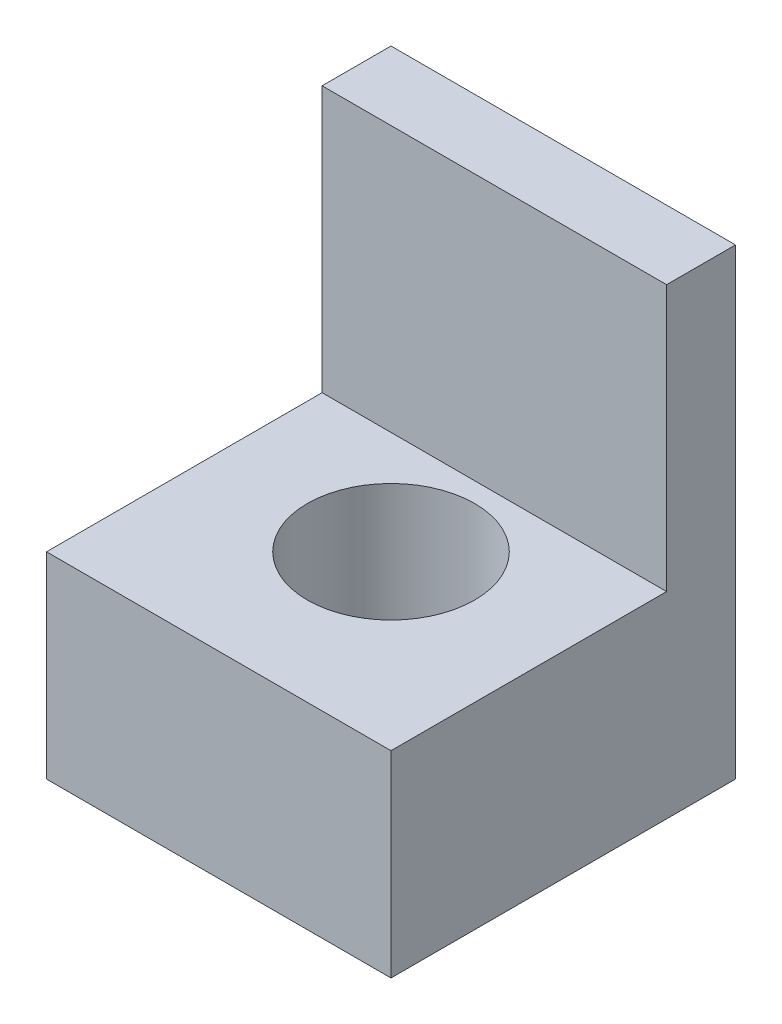
ISO-10303-21;
HEADER;
FILE_DESCRIPTION(('STEP AP214'),'2;1');
FILE_NAME('part.step','',(''),(''),'','','');
FILE_SCHEMA(('AUTOMOTIVE_DESIGN { 1 0 10303 214 1 1 1 1 }'));
ENDSEC;
DATA;
#1=APPLICATION_CONTEXT('core data for automotive mechanical design processes');
#2=APPLICATION_PROTOCOL_DEFINITION('international standard','automotive_design',2000,#1);
#3=PRODUCT_CONTEXT('',#1,'mechanical');
#4=PRODUCT('Part','Part','',(#3));
#5=PRODUCT_RELATED_PRODUCT_CATEGORY('part','',(#4));
#6=PRODUCT_DEFINITION_FORMATION('','',#4);
#7=PRODUCT_DEFINITION_CONTEXT('part definition',#1,'design');
#8=PRODUCT_DEFINITION('design','',#6,#7);
#9=PRODUCT_DEFINITION_SHAPE('','',#8);
#10=(LENGTH_UNIT() NAMED_UNIT(*) SI_UNIT(.MILLI.,.METRE.));
#11=(NAMED_UNIT(*) PLANE_ANGLE_UNIT() SI_UNIT($,.RADIAN.));
#12=(NAMED_UNIT(*) SI_UNIT($,.STERADIAN.) SOLID_ANGLE_UNIT());
#13=UNCERTAINTY_MEASURE_WITH_UNIT(LENGTH_MEASURE(1.E-05),#10,'distance_accuracy_value','');
#14=(GEOMETRIC_REPRESENTATION_CONTEXT(3) GLOBAL_UNCERTAINTY_ASSIGNED_CONTEXT((#13)) GLOBAL_UNIT_ASSIGNED_CONTEXT((#10,
#11,#12)) REPRESENTATION_CONTEXT('',''));
#15=CARTESIAN_POINT('',(0.,0.,0.));
#16=DIRECTION('',(0.,0.,1.));
#17=DIRECTION('',(1.,0.,0.));
#18=AXIS2_PLACEMENT_3D('',#15,#16,#17);
#19=CARTESIAN_POINT('',(0.,20.,0.));
#20=DIRECTION('',(0.,-1.,0.));
#21=DIRECTION('',(0.,0.,-1.));
#22=AXIS2_PLACEMENT_3D('',#19,#20,#21);
#23=PLANE('',#22);
#24=CARTESIAN_POINT('',(0.,20.,0.));
#25=DIRECTION('',(0.,-1.,0.));
#26=DIRECTION('',(0.,0.,-1.));
#27=AXIS2_PLACEMENT_3D('',#24,#25,#26);
#28=CIRCLE('',#27,8.5);
#29=CARTESIAN_POINT('',(0.,20.,-8.5));
#30=VERTEX_POINT('',#29);
#31=EDGE_CURVE('E138',#30,#30,#28,.T.);
#32=ORIENTED_EDGE('',*,*,#31,.T.);
#33=EDGE_LOOP('',(#32));
#34=FACE_BOUND('',#33,.T.);
#35=DIRECTION('',(1.,0.,0.));
#36=VECTOR('',#35,1.);
#37=CARTESIAN_POINT('',(-17.5,20.,-10.5));
#38=LINE('',#37,#36);
#39=CARTESIAN_POINT('',(-17.5,20.,-10.5));
#40=VERTEX_POINT('',#39);
#41=CARTESIAN_POINT('',(17.5,20.,-10.5));
#42=VERTEX_POINT('',#41);
#43=EDGE_CURVE('E54',#40,#42,#38,.T.);
#44=ORIENTED_EDGE('',*,*,#43,.F.);
#45=DIRECTION('',(0.,0.,1.));
#46=VECTOR('',#45,1.);
#47=CARTESIAN_POINT('',(-17.5,20.,17.5));
#48=LINE('',#47,#46);
#49=CARTESIAN_POINT('',(-17.5,20.,17.5));
#50=VERTEX_POINT('',#49);
#51=EDGE_CURVE('E140',#40,#50,#48,.T.);
#52=ORIENTED_EDGE('',*,*,#51,.T.);
#53=DIRECTION('',(1.,0.,0.));
#54=VECTOR('',#53,1.);
#55=CARTESIAN_POINT('',(-17.5,20.,17.5));
#56=LINE('',#55,#54);
#57=CARTESIAN_POINT('',(17.5,20.,17.5));
#58=VERTEX_POINT('',#57);
#59=EDGE_CURVE('E60',#50,#58,#56,.T.);
#60=ORIENTED_EDGE('',*,*,#59,.T.);
#61=DIRECTION('',(0.,0.,-1.));
#62=VECTOR('',#61,1.);
#63=CARTESIAN_POINT('',(17.5,20.,17.5));
#64=LINE('',#63,#62);
#65=EDGE_CURVE('E89',#58,#42,#64,.T.);
#66=ORIENTED_EDGE('',*,*,#65,.T.);
#67=EDGE_LOOP('',(#44,#52,#60,#66));
#68=FACE_BOUND('',#67,.T.);
#69=ADVANCED_FACE('F39',(#34,#68),#23,.F.);
#70=CARTESIAN_POINT('',(17.5,20.,17.5));
#71=DIRECTION('',(-1.,0.,0.));
#72=DIRECTION('',(0.,0.,1.));
#73=AXIS2_PLACEMENT_3D('',#70,#71,#72);
#74=PLANE('',#73);
#75=DIRECTION('',(0.,0.,-1.));
#76=VECTOR('',#75,1.);
#77=CARTESIAN_POINT('',(17.5,0.,17.5));
#78=LINE('',#77,#76);
#79=CARTESIAN_POINT('',(17.5,0.,17.5));
#80=VERTEX_POINT('',#79);
#81=CARTESIAN_POINT('',(17.5,0.,-17.5));
#82=VERTEX_POINT('',#81);
#83=EDGE_CURVE('E95',#80,#82,#78,.T.);
#84=ORIENTED_EDGE('',*,*,#83,.T.);
#85=DIRECTION('',(0.,-1.,0.));
#86=VECTOR('',#85,1.);
#87=CARTESIAN_POINT('',(17.5,20.,-17.5));
#88=LINE('',#87,#86);
#89=CARTESIAN_POINT('',(17.5,47.,-17.5));
#90=VERTEX_POINT('',#89);
#91=EDGE_CURVE('E11',#90,#82,#88,.T.);
#92=ORIENTED_EDGE('',*,*,#91,.F.);
#93=DIRECTION('',(0.,0.,-1.));
#94=VECTOR('',#93,1.);
#95=CARTESIAN_POINT('',(17.5,47.,-17.5));
#96=LINE('',#95,#94);
#97=CARTESIAN_POINT('',(17.5,47.,-10.5));
#98=VERTEX_POINT('',#97);
#99=EDGE_CURVE('E131',#98,#90,#96,.T.);
#100=ORIENTED_EDGE('',*,*,#99,.F.);
#101=DIRECTION('',(0.,-1.,0.));
#102=VECTOR('',#101,1.);
#103=CARTESIAN_POINT('',(17.5,47.,-10.5));
#104=LINE('',#103,#102);
#105=EDGE_CURVE('E104',#98,#42,#104,.T.);
#106=ORIENTED_EDGE('',*,*,#105,.T.);
#107=ORIENTED_EDGE('',*,*,#65,.F.);
#108=DIRECTION('',(0.,-1.,0.));
#109=VECTOR('',#108,1.);
#110=CARTESIAN_POINT('',(17.5,20.,17.5));
#111=LINE('',#110,#109);
#112=EDGE_CURVE('E82',#58,#80,#111,.T.);
#113=ORIENTED_EDGE('',*,*,#112,.T.);
#114=EDGE_LOOP('',(#84,#92,#100,#106,#107,#113));
#115=FACE_BOUND('',#114,.T.);
#116=ADVANCED_FACE('F41',(#115),#74,.F.);
#117=CARTESIAN_POINT('',(-17.5,20.,-17.5));
#118=DIRECTION('',(0.,0.,1.));
#119=DIRECTION('',(1.,0.,0.));
#120=AXIS2_PLACEMENT_3D('',#117,#118,#119);
#121=PLANE('',#120);
#122=DIRECTION('',(-1.,0.,0.));
#123=VECTOR('',#122,1.);
#124=CARTESIAN_POINT('',(-17.5,0.,-17.5));
#125=LINE('',#124,#123);
#126=CARTESIAN_POINT('',(-17.5,0.,-17.5));
#127=VERTEX_POINT('',#126);
#128=EDGE_CURVE('E99',#82,#127,#125,.T.);
#129=ORIENTED_EDGE('',*,*,#128,.T.);
#130=DIRECTION('',(0.,-1.,0.));
#131=VECTOR('',#130,1.);
#132=CARTESIAN_POINT('',(-17.5,20.,-17.5));
#133=LINE('',#132,#131);
#134=CARTESIAN_POINT('',(-17.5,47.,-17.5));
#135=VERTEX_POINT('',#134);
#136=EDGE_CURVE('E47',#135,#127,#133,.T.);
#137=ORIENTED_EDGE('',*,*,#136,.F.);
#138=DIRECTION('',(-1.,0.,0.));
#139=VECTOR('',#138,1.);
#140=CARTESIAN_POINT('',(-17.5,47.,-17.5));
#141=LINE('',#140,#139);
#142=EDGE_CURVE('E123',#90,#135,#141,.T.);
#143=ORIENTED_EDGE('',*,*,#142,.F.);
#144=ORIENTED_EDGE('',*,*,#91,.T.);
#145=EDGE_LOOP('',(#129,#137,#143,#144));
#146=FACE_BOUND('',#145,.T.);
#147=ADVANCED_FACE('F121',(#146),#121,.F.);
#148=CARTESIAN_POINT('',(-17.5,20.,17.5));
#149=DIRECTION('',(1.,0.,0.));
#150=DIRECTION('',(0.,0.,-1.));
#151=AXIS2_PLACEMENT_3D('',#148,#149,#150);
#152=PLANE('',#151);
#153=DIRECTION('',(0.,0.,1.));
#154=VECTOR('',#153,1.);
#155=CARTESIAN_POINT('',(-17.5,0.,17.5));
#156=LINE('',#155,#154);
#157=CARTESIAN_POINT('',(-17.5,0.,17.5));
#158=VERTEX_POINT('',#157);
#159=EDGE_CURVE('E90',#127,#158,#156,.T.);
#160=ORIENTED_EDGE('',*,*,#159,.T.);
#161=DIRECTION('',(0.,-1.,0.));
#162=VECTOR('',#161,1.);
#163=CARTESIAN_POINT('',(-17.5,20.,17.5));
#164=LINE('',#163,#162);
#165=EDGE_CURVE('E85',#50,#158,#164,.T.);
#166=ORIENTED_EDGE('',*,*,#165,.F.);
#167=ORIENTED_EDGE('',*,*,#51,.F.);
#168=DIRECTION('',(0.,-1.,0.));
#169=VECTOR('',#168,1.);
#170=CARTESIAN_POINT('',(-17.5,47.,-10.5));
#171=LINE('',#170,#169);
#172=CARTESIAN_POINT('',(-17.5,47.,-10.5));
#173=VERTEX_POINT('',#172);
#174=EDGE_CURVE('E100',#173,#40,#171,.T.);
#175=ORIENTED_EDGE('',*,*,#174,.F.);
#176=DIRECTION('',(0.,0.,1.));
#177=VECTOR('',#176,1.);
#178=CARTESIAN_POINT('',(-17.5,47.,-17.5));
#179=LINE('',#178,#177);
#180=EDGE_CURVE('E117',#135,#173,#179,.T.);
#181=ORIENTED_EDGE('',*,*,#180,.F.);
#182=ORIENTED_EDGE('',*,*,#136,.T.);
#183=EDGE_LOOP('',(#160,#166,#167,#175,#181,#182));
#184=FACE_BOUND('',#183,.T.);
#185=ADVANCED_FACE('F114',(#184),#152,.F.);
#186=CARTESIAN_POINT('',(-17.5,20.,17.5));
#187=DIRECTION('',(0.,0.,-1.));
#188=DIRECTION('',(-1.,0.,0.));
#189=AXIS2_PLACEMENT_3D('',#186,#187,#188);
#190=PLANE('',#189);
#191=DIRECTION('',(1.,0.,0.));
#192=VECTOR('',#191,1.);
#193=CARTESIAN_POINT('',(-17.5,0.,17.5));
#194=LINE('',#193,#192);
#195=EDGE_CURVE('E79',#158,#80,#194,.T.);
#196=ORIENTED_EDGE('',*,*,#195,.T.);
#197=ORIENTED_EDGE('',*,*,#112,.F.);
#198=ORIENTED_EDGE('',*,*,#59,.F.);
#199=ORIENTED_EDGE('',*,*,#165,.T.);
#200=EDGE_LOOP('',(#196,#197,#198,#199));
#201=FACE_BOUND('',#200,.T.);
#202=ADVANCED_FACE('F81',(#201),#190,.F.);
#203=CARTESIAN_POINT('',(0.,0.,0.));
#204=DIRECTION('',(0.,-1.,0.));
#205=DIRECTION('',(0.,0.,-1.));
#206=AXIS2_PLACEMENT_3D('',#203,#204,#205);
#207=PLANE('',#206);
#208=CARTESIAN_POINT('',(12.5,0.,-5.5));
#209=DIRECTION('',(0.,-1.,0.));
#210=DIRECTION('',(0.,0.,-1.));
#211=AXIS2_PLACEMENT_3D('',#208,#209,#210);
#212=CIRCLE('',#211,1.24999999999999);
#213=CARTESIAN_POINT('',(12.5,0.,-6.74999999999999));
#214=VERTEX_POINT('',#213);
#215=EDGE_CURVE('E176',#214,#214,#212,.T.);
#216=ORIENTED_EDGE('',*,*,#215,.F.);
#217=EDGE_LOOP('',(#216));
#218=FACE_BOUND('',#217,.T.);
#219=CARTESIAN_POINT('',(-12.5,0.,-5.5));
#220=DIRECTION('',(0.,-1.,0.));
#221=DIRECTION('',(0.,0.,-1.));
#222=AXIS2_PLACEMENT_3D('',#219,#220,#221);
#223=CIRCLE('',#222,1.24999999999999);
#224=CARTESIAN_POINT('',(-12.5,0.,-6.74999999999999));
#225=VERTEX_POINT('',#224);
#226=EDGE_CURVE('E170',#225,#225,#223,.T.);
#227=ORIENTED_EDGE('',*,*,#226,.F.);
#228=EDGE_LOOP('',(#227));
#229=FACE_BOUND('',#228,.T.);
#230=CARTESIAN_POINT('',(-12.5,0.,12.5));
#231=DIRECTION('',(0.,-1.,0.));
#232=DIRECTION('',(0.,0.,-1.));
#233=AXIS2_PLACEMENT_3D('',#230,#231,#232);
#234=CIRCLE('',#233,1.24999999999999);
#235=CARTESIAN_POINT('',(-12.5,0.,11.25));
#236=VERTEX_POINT('',#235);
#237=EDGE_CURVE('E164',#236,#236,#234,.T.);
#238=ORIENTED_EDGE('',*,*,#237,.F.);
#239=EDGE_LOOP('',(#238));
#240=FACE_BOUND('',#239,.T.);
#241=CARTESIAN_POINT('',(12.5,0.,12.5));
#242=DIRECTION('',(0.,-1.,0.));
#243=DIRECTION('',(0.,0.,-1.));
#244=AXIS2_PLACEMENT_3D('',#241,#242,#243);
#245=CIRCLE('',#244,1.24999999999999);
#246=CARTESIAN_POINT('',(12.5,0.,11.25));
#247=VERTEX_POINT('',#246);
#248=EDGE_CURVE('E158',#247,#247,#245,.T.);
#249=ORIENTED_EDGE('',*,*,#248,.F.);
#250=EDGE_LOOP('',(#249));
#251=FACE_BOUND('',#250,.T.);
#252=CARTESIAN_POINT('',(0.,0.,0.));
#253=DIRECTION('',(0.,-1.,0.));
#254=DIRECTION('',(0.,0.,-1.));
#255=AXIS2_PLACEMENT_3D('',#252,#253,#254);
#256=CIRCLE('',#255,8.5);
#257=CARTESIAN_POINT('',(0.,0.,-8.5));
#258=VERTEX_POINT('',#257);
#259=EDGE_CURVE('E150',#258,#258,#256,.T.);
#260=ORIENTED_EDGE('',*,*,#259,.F.);
#261=EDGE_LOOP('',(#260));
#262=FACE_BOUND('',#261,.T.);
#263=ORIENTED_EDGE('',*,*,#83,.F.);
#264=ORIENTED_EDGE('',*,*,#195,.F.);
#265=ORIENTED_EDGE('',*,*,#159,.F.);
#266=ORIENTED_EDGE('',*,*,#128,.F.);
#267=EDGE_LOOP('',(#263,#264,#265,#266));
#268=FACE_BOUND('',#267,.T.);
#269=ADVANCED_FACE('F98',(#218,#229,#240,#251,#262,#268),#207,.T.);
#270=CARTESIAN_POINT('',(-17.5,47.,-10.5));
#271=DIRECTION('',(0.,0.,-1.));
#272=DIRECTION('',(-1.,0.,0.));
#273=AXIS2_PLACEMENT_3D('',#270,#271,#272);
#274=PLANE('',#273);
#275=ORIENTED_EDGE('',*,*,#43,.T.);
#276=ORIENTED_EDGE('',*,*,#105,.F.);
#277=DIRECTION('',(1.,0.,0.));
#278=VECTOR('',#277,1.);
#279=CARTESIAN_POINT('',(-17.5,47.,-10.5));
#280=LINE('',#279,#278);
#281=EDGE_CURVE('E134',#173,#98,#280,.T.);
#282=ORIENTED_EDGE('',*,*,#281,.F.);
#283=ORIENTED_EDGE('',*,*,#174,.T.);
#284=EDGE_LOOP('',(#275,#276,#282,#283));
#285=FACE_BOUND('',#284,.T.);
#286=ADVANCED_FACE('F143',(#285),#274,.F.);
#287=CARTESIAN_POINT('',(0.,47.,0.));
#288=DIRECTION('',(0.,1.,0.));
#289=DIRECTION('',(0.,0.,1.));
#290=AXIS2_PLACEMENT_3D('',#287,#288,#289);
#291=PLANE('',#290);
#292=ORIENTED_EDGE('',*,*,#180,.T.);
#293=ORIENTED_EDGE('',*,*,#281,.T.);
#294=ORIENTED_EDGE('',*,*,#99,.T.);
#295=ORIENTED_EDGE('',*,*,#142,.T.);
#296=EDGE_LOOP('',(#292,#293,#294,#295));
#297=FACE_BOUND('',#296,.T.);
#298=ADVANCED_FACE('F127',(#297),#291,.T.);
#299=CARTESIAN_POINT('',(0.,20.,0.));
#300=DIRECTION('',(0.,-1.,0.));
#301=DIRECTION('',(0.,0.,-1.));
#302=AXIS2_PLACEMENT_3D('',#299,#300,#301);
#303=CYLINDRICAL_SURFACE('',#302,8.5);
#304=ORIENTED_EDGE('',*,*,#31,.F.);
#305=EDGE_LOOP('',(#304));
#306=FACE_BOUND('',#305,.T.);
#307=ORIENTED_EDGE('',*,*,#259,.T.);
#308=EDGE_LOOP('',(#307));
#309=FACE_BOUND('',#308,.T.);
#310=ADVANCED_FACE('F193',(#306,#309),#303,.F.);
#311=CARTESIAN_POINT('',(12.5,7.50000000000001,12.5));
#312=DIRECTION('',(0.,-1.,0.));
#313=DIRECTION('',(0.,0.,-1.));
#314=AXIS2_PLACEMENT_3D('',#311,#312,#313);
#315=CONICAL_SURFACE('',#314,1.24999999999999,1.02974425867665);
#316=CARTESIAN_POINT('',(12.5,8.25107577378445,12.5));
#317=VERTEX_POINT('',#316);
#318=VERTEX_LOOP('',#317);
#319=FACE_BOUND('',#318,.T.);
#320=CARTESIAN_POINT('',(12.5,7.50000000000001,12.5));
#321=DIRECTION('',(0.,-1.,0.));
#322=DIRECTION('',(0.,0.,-1.));
#323=AXIS2_PLACEMENT_3D('',#320,#321,#322);
#324=CIRCLE('',#323,1.24999999999999);
#325=CARTESIAN_POINT('',(12.5,7.50000000000001,11.25));
#326=VERTEX_POINT('',#325);
#327=EDGE_CURVE('E153',#326,#326,#324,.T.);
#328=ORIENTED_EDGE('',*,*,#327,.T.);
#329=EDGE_LOOP('',(#328));
#330=FACE_BOUND('',#329,.T.);
#331=ADVANCED_FACE('F195',(#319,#330),#315,.F.);
#332=CARTESIAN_POINT('',(12.5,0.,12.5));
#333=DIRECTION('',(0.,-1.,0.));
#334=DIRECTION('',(0.,0.,-1.));
#335=AXIS2_PLACEMENT_3D('',#332,#333,#334);
#336=CYLINDRICAL_SURFACE('',#335,1.24999999999999);
#337=ORIENTED_EDGE('',*,*,#327,.F.);
#338=EDGE_LOOP('',(#337));
#339=FACE_BOUND('',#338,.T.);
#340=ORIENTED_EDGE('',*,*,#248,.T.);
#341=EDGE_LOOP('',(#340));
#342=FACE_BOUND('',#341,.T.);
#343=ADVANCED_FACE('F202',(#339,#342),#336,.F.);
#344=CARTESIAN_POINT('',(-12.5,7.50000000000001,12.5));
#345=DIRECTION('',(0.,-1.,0.));
#346=DIRECTION('',(0.,0.,-1.));
#347=AXIS2_PLACEMENT_3D('',#344,#345,#346);
#348=CONICAL_SURFACE('',#347,1.24999999999999,1.02974425867665);
#349=CARTESIAN_POINT('',(-12.5,8.25107577378445,12.5));
#350=VERTEX_POINT('',#349);
#351=VERTEX_LOOP('',#350);
#352=FACE_BOUND('',#351,.T.);
#353=CARTESIAN_POINT('',(-12.5,7.50000000000001,12.5));
#354=DIRECTION('',(0.,-1.,0.));
#355=DIRECTION('',(0.,0.,-1.));
#356=AXIS2_PLACEMENT_3D('',#353,#354,#355);
#357=CIRCLE('',#356,1.24999999999999);
#358=CARTESIAN_POINT('',(-12.5,7.50000000000001,11.25));
#359=VERTEX_POINT('',#358);
#360=EDGE_CURVE('E161',#359,#359,#357,.T.);
#361=ORIENTED_EDGE('',*,*,#360,.T.);
#362=EDGE_LOOP('',(#361));
#363=FACE_BOUND('',#362,.T.);
#364=ADVANCED_FACE('F268',(#352,#363),#348,.F.);
#365=CARTESIAN_POINT('',(-12.5,0.,12.5));
#366=DIRECTION('',(0.,-1.,0.));
#367=DIRECTION('',(0.,0.,-1.));
#368=AXIS2_PLACEMENT_3D('',#365,#366,#367);
#369=CYLINDRICAL_SURFACE('',#368,1.24999999999999);
#370=ORIENTED_EDGE('',*,*,#360,.F.);
#371=EDGE_LOOP('',(#370));
#372=FACE_BOUND('',#371,.T.);
#373=ORIENTED_EDGE('',*,*,#237,.T.);
#374=EDGE_LOOP('',(#373));
#375=FACE_BOUND('',#374,.T.);
#376=ADVANCED_FACE('F278',(#372,#375),#369,.F.);
#377=CARTESIAN_POINT('',(-12.5,7.50000000000001,-5.5));
#378=DIRECTION('',(0.,-1.,0.));
#379=DIRECTION('',(0.,0.,-1.));
#380=AXIS2_PLACEMENT_3D('',#377,#378,#379);
#381=CONICAL_SURFACE('',#380,1.24999999999999,1.02974425867665);
#382=CARTESIAN_POINT('',(-12.5,8.25107577378445,-5.5));
#383=VERTEX_POINT('',#382);
#384=VERTEX_LOOP('',#383);
#385=FACE_BOUND('',#384,.T.);
#386=CARTESIAN_POINT('',(-12.5,7.50000000000001,-5.5));
#387=DIRECTION('',(0.,-1.,0.));
#388=DIRECTION('',(0.,0.,-1.));
#389=AXIS2_PLACEMENT_3D('',#386,#387,#388);
#390=CIRCLE('',#389,1.24999999999999);
#391=CARTESIAN_POINT('',(-12.5,7.50000000000001,-6.74999999999999));
#392=VERTEX_POINT('',#391);
#393=EDGE_CURVE('E167',#392,#392,#390,.T.);
#394=ORIENTED_EDGE('',*,*,#393,.T.);
#395=EDGE_LOOP('',(#394));
#396=FACE_BOUND('',#395,.T.);
#397=ADVANCED_FACE('F287',(#385,#396),#381,.F.);
#398=CARTESIAN_POINT('',(-12.5,0.,-5.5));
#399=DIRECTION('',(0.,-1.,0.));
#400=DIRECTION('',(0.,0.,-1.));
#401=AXIS2_PLACEMENT_3D('',#398,#399,#400);
#402=CYLINDRICAL_SURFACE('',#401,1.24999999999999);
#403=ORIENTED_EDGE('',*,*,#393,.F.);
#404=EDGE_LOOP('',(#403));
#405=FACE_BOUND('',#404,.T.);
#406=ORIENTED_EDGE('',*,*,#226,.T.);
#407=EDGE_LOOP('',(#406));
#408=FACE_BOUND('',#407,.T.);
#409=ADVANCED_FACE('F297',(#405,#408),#402,.F.);
#410=CARTESIAN_POINT('',(12.5,7.50000000000001,-5.5));
#411=DIRECTION('',(0.,-1.,0.));
#412=DIRECTION('',(0.,0.,-1.));
#413=AXIS2_PLACEMENT_3D('',#410,#411,#412);
#414=CONICAL_SURFACE('',#413,1.24999999999999,1.02974425867665);
#415=CARTESIAN_POINT('',(12.5,8.25107577378445,-5.5));
#416=VERTEX_POINT('',#415);
#417=VERTEX_LOOP('',#416);
#418=FACE_BOUND('',#417,.T.);
#419=CARTESIAN_POINT('',(12.5,7.50000000000001,-5.5));
#420=DIRECTION('',(0.,-1.,0.));
#421=DIRECTION('',(0.,0.,-1.));
#422=AXIS2_PLACEMENT_3D('',#419,#420,#421);
#423=CIRCLE('',#422,1.24999999999999);
#424=CARTESIAN_POINT('',(12.5,7.50000000000001,-6.74999999999999));
#425=VERTEX_POINT('',#424);
#426=EDGE_CURVE('E173',#425,#425,#423,.T.);
#427=ORIENTED_EDGE('',*,*,#426,.T.);
#428=EDGE_LOOP('',(#427));
#429=FACE_BOUND('',#428,.T.);
#430=ADVANCED_FACE('F306',(#418,#429),#414,.F.);
#431=CARTESIAN_POINT('',(12.5,0.,-5.5));
#432=DIRECTION('',(0.,-1.,0.));
#433=DIRECTION('',(0.,0.,-1.));
#434=AXIS2_PLACEMENT_3D('',#431,#432,#433);
#435=CYLINDRICAL_SURFACE('',#434,1.24999999999999);
#436=ORIENTED_EDGE('',*,*,#426,.F.);
#437=EDGE_LOOP('',(#436));
#438=FACE_BOUND('',#437,.T.);
#439=ORIENTED_EDGE('',*,*,#215,.T.);
#440=EDGE_LOOP('',(#439));
#441=FACE_BOUND('',#440,.T.);
#442=ADVANCED_FACE('F180',(#438,#441),#435,.F.);
#443=CLOSED_SHELL('',(#69,#116,#147,#185,#202,#269,#286,#298,#310,#331,#343,#364,#376,#397,#409,
#430,#442));
#444=MANIFOLD_SOLID_BREP('B2',#443);
#445=ADVANCED_BREP_SHAPE_REPRESENTATION('',(#18,#444),#14);
#446=SHAPE_DEFINITION_REPRESENTATION(#9,#445);
ENDSEC;
END-ISO-10303-21;
